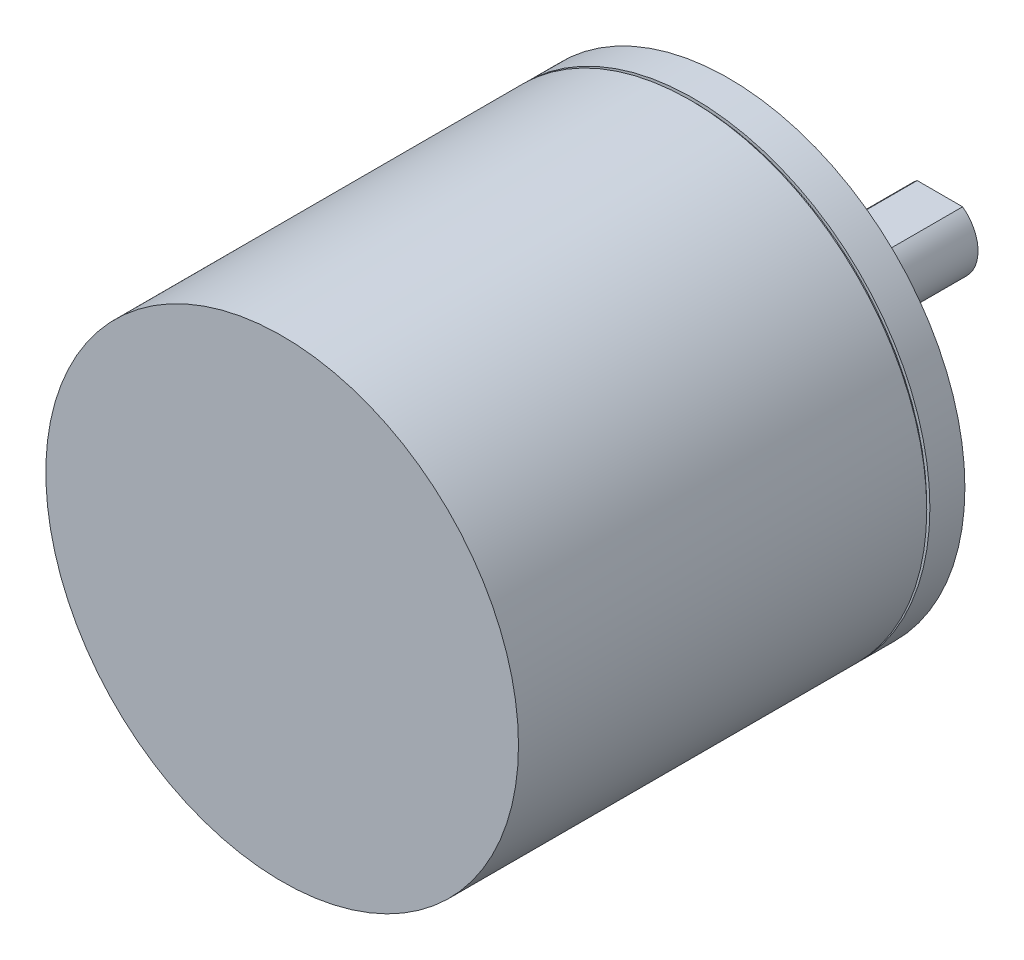
ISO-10303-21;
HEADER;
FILE_DESCRIPTION(('STEP AP214'),'2;1');
FILE_NAME('part.step','',(''),(''),'','','');
FILE_SCHEMA(('AUTOMOTIVE_DESIGN { 1 0 10303 214 1 1 1 1 }'));
ENDSEC;
DATA;
#1=APPLICATION_CONTEXT('core data for automotive mechanical design processes');
#2=APPLICATION_PROTOCOL_DEFINITION('international standard','automotive_design',2000,#1);
#3=PRODUCT_CONTEXT('',#1,'mechanical');
#4=PRODUCT('Part','Part','',(#3));
#5=PRODUCT_RELATED_PRODUCT_CATEGORY('part','',(#4));
#6=PRODUCT_DEFINITION_FORMATION('','',#4);
#7=PRODUCT_DEFINITION_CONTEXT('part definition',#1,'design');
#8=PRODUCT_DEFINITION('design','',#6,#7);
#9=PRODUCT_DEFINITION_SHAPE('','',#8);
#10=(LENGTH_UNIT() NAMED_UNIT(*) SI_UNIT(.MILLI.,.METRE.));
#11=(NAMED_UNIT(*) PLANE_ANGLE_UNIT() SI_UNIT($,.RADIAN.));
#12=(NAMED_UNIT(*) SI_UNIT($,.STERADIAN.) SOLID_ANGLE_UNIT());
#13=UNCERTAINTY_MEASURE_WITH_UNIT(LENGTH_MEASURE(1.E-05),#10,'distance_accuracy_value','');
#14=(GEOMETRIC_REPRESENTATION_CONTEXT(3) GLOBAL_UNCERTAINTY_ASSIGNED_CONTEXT((#13)) GLOBAL_UNIT_ASSIGNED_CONTEXT((#10,
#11,#12)) REPRESENTATION_CONTEXT('',''));
#15=CARTESIAN_POINT('',(0.,0.,0.));
#16=DIRECTION('',(0.,0.,1.));
#17=DIRECTION('',(1.,0.,0.));
#18=AXIS2_PLACEMENT_3D('',#15,#16,#17);
#19=CARTESIAN_POINT('',(0.,0.,0.1));
#20=DIRECTION('',(0.,0.,-1.));
#21=DIRECTION('',(1.,0.,0.));
#22=AXIS2_PLACEMENT_3D('',#19,#20,#21);
#23=CYLINDRICAL_SURFACE('',#22,18.9);
#24=CARTESIAN_POINT('',(0.,0.,-32.8));
#25=DIRECTION('',(0.,0.,1.));
#26=DIRECTION('',(1.,0.,0.));
#27=AXIS2_PLACEMENT_3D('',#24,#25,#26);
#28=CIRCLE('',#27,18.9);
#29=CARTESIAN_POINT('',(18.9,0.,-32.8));
#30=VERTEX_POINT('',#29);
#31=EDGE_CURVE('E41',#30,#30,#28,.F.);
#32=ORIENTED_EDGE('',*,*,#31,.T.);
#33=EDGE_LOOP('',(#32));
#34=FACE_BOUND('',#33,.T.);
#35=CARTESIAN_POINT('',(0.,0.,-35.6));
#36=DIRECTION('',(0.,0.,1.));
#37=DIRECTION('',(1.,0.,0.));
#38=AXIS2_PLACEMENT_3D('',#35,#36,#37);
#39=CIRCLE('',#38,18.9);
#40=CARTESIAN_POINT('',(18.9,0.,-35.6));
#41=VERTEX_POINT('',#40);
#42=EDGE_CURVE('E103',#41,#41,#39,.T.);
#43=ORIENTED_EDGE('',*,*,#42,.T.);
#44=EDGE_LOOP('',(#43));
#45=FACE_BOUND('',#44,.T.);
#46=ADVANCED_FACE('F37',(#34,#45),#23,.T.);
#47=CARTESIAN_POINT('',(0.,0.,-35.6));
#48=DIRECTION('',(0.,0.,-1.));
#49=DIRECTION('',(1.,0.,0.));
#50=AXIS2_PLACEMENT_3D('',#47,#48,#49);
#51=PLANE('',#50);
#52=CARTESIAN_POINT('',(-12.9037785163881,-7.45000000000006,-35.6));
#53=DIRECTION('',(0.,0.,1.));
#54=DIRECTION('',(-0.500000000000004,0.866025403784436,0.));
#55=AXIS2_PLACEMENT_3D('',#52,#53,#54);
#56=CIRCLE('',#55,1.5);
#57=CARTESIAN_POINT('',(-13.6537785163881,-6.15096189432341,-35.6));
#58=VERTEX_POINT('',#57);
#59=EDGE_CURVE('E84',#58,#58,#56,.T.);
#60=ORIENTED_EDGE('',*,*,#59,.T.);
#61=EDGE_LOOP('',(#60));
#62=FACE_BOUND('',#61,.T.);
#63=CARTESIAN_POINT('',(12.9037785163882,-7.44999999999988,-35.6));
#64=DIRECTION('',(0.,0.,1.));
#65=DIRECTION('',(-0.499999999999992,-0.866025403784443,0.));
#66=AXIS2_PLACEMENT_3D('',#63,#64,#65);
#67=CIRCLE('',#66,1.5);
#68=CARTESIAN_POINT('',(12.1537785163882,-8.74903810567655,-35.6));
#69=VERTEX_POINT('',#68);
#70=EDGE_CURVE('E119',#69,#69,#67,.T.);
#71=ORIENTED_EDGE('',*,*,#70,.T.);
#72=EDGE_LOOP('',(#71));
#73=FACE_BOUND('',#72,.T.);
#74=CARTESIAN_POINT('',(0.,14.9,-35.6));
#75=DIRECTION('',(0.,0.,1.));
#76=DIRECTION('',(1.,0.,0.));
#77=AXIS2_PLACEMENT_3D('',#74,#75,#76);
#78=CIRCLE('',#77,1.5);
#79=CARTESIAN_POINT('',(1.5,14.9,-35.6));
#80=VERTEX_POINT('',#79);
#81=EDGE_CURVE('E94',#80,#80,#78,.T.);
#82=ORIENTED_EDGE('',*,*,#81,.T.);
#83=EDGE_LOOP('',(#82));
#84=FACE_BOUND('',#83,.T.);
#85=CARTESIAN_POINT('',(0.,0.,-35.6));
#86=DIRECTION('',(0.,0.,1.));
#87=DIRECTION('',(1.,0.,0.));
#88=AXIS2_PLACEMENT_3D('',#85,#86,#87);
#89=CIRCLE('',#88,10.);
#90=CARTESIAN_POINT('',(10.,0.,-35.6));
#91=VERTEX_POINT('',#90);
#92=EDGE_CURVE('E104',#91,#91,#89,.T.);
#93=ORIENTED_EDGE('',*,*,#92,.T.);
#94=EDGE_LOOP('',(#93));
#95=FACE_BOUND('',#94,.T.);
#96=ORIENTED_EDGE('',*,*,#42,.F.);
#97=EDGE_LOOP('',(#96));
#98=FACE_BOUND('',#97,.T.);
#99=ADVANCED_FACE('F135',(#62,#73,#84,#95,#98),#51,.T.);
#100=CARTESIAN_POINT('',(0.,0.,-40.5));
#101=DIRECTION('',(0.,0.,1.));
#102=DIRECTION('',(-1.,0.,0.));
#103=AXIS2_PLACEMENT_3D('',#100,#101,#102);
#104=CYLINDRICAL_SURFACE('',#103,10.);
#105=CARTESIAN_POINT('',(0.,0.,-40.5));
#106=DIRECTION('',(0.,0.,1.));
#107=DIRECTION('',(1.,0.,0.));
#108=AXIS2_PLACEMENT_3D('',#105,#106,#107);
#109=CIRCLE('',#108,10.);
#110=CARTESIAN_POINT('',(10.,0.,-40.5));
#111=VERTEX_POINT('',#110);
#112=EDGE_CURVE('E75',#111,#111,#109,.T.);
#113=ORIENTED_EDGE('',*,*,#112,.T.);
#114=EDGE_LOOP('',(#113));
#115=FACE_BOUND('',#114,.T.);
#116=ORIENTED_EDGE('',*,*,#92,.F.);
#117=EDGE_LOOP('',(#116));
#118=FACE_BOUND('',#117,.T.);
#119=ADVANCED_FACE('F157',(#115,#118),#104,.T.);
#120=CARTESIAN_POINT('',(0.,0.,-40.5));
#121=DIRECTION('',(0.,0.,-1.));
#122=DIRECTION('',(1.,0.,0.));
#123=AXIS2_PLACEMENT_3D('',#120,#121,#122);
#124=PLANE('',#123);
#125=CARTESIAN_POINT('',(0.,0.,-40.5));
#126=DIRECTION('',(0.,0.,1.));
#127=DIRECTION('',(1.,0.,0.));
#128=AXIS2_PLACEMENT_3D('',#125,#126,#127);
#129=CIRCLE('',#128,7.575);
#130=CARTESIAN_POINT('',(7.575,0.,-40.5));
#131=VERTEX_POINT('',#130);
#132=EDGE_CURVE('E90',#131,#131,#129,.T.);
#133=ORIENTED_EDGE('',*,*,#132,.T.);
#134=EDGE_LOOP('',(#133));
#135=FACE_BOUND('',#134,.T.);
#136=ORIENTED_EDGE('',*,*,#112,.F.);
#137=EDGE_LOOP('',(#136));
#138=FACE_BOUND('',#137,.T.);
#139=ADVANCED_FACE('F179',(#135,#138),#124,.T.);
#140=CARTESIAN_POINT('',(0.,14.9,-27.6));
#141=DIRECTION('',(0.,0.,-1.));
#142=DIRECTION('',(1.,0.,0.));
#143=AXIS2_PLACEMENT_3D('',#140,#141,#142);
#144=CYLINDRICAL_SURFACE('',#143,1.5);
#145=CARTESIAN_POINT('',(0.,14.9,-27.6));
#146=DIRECTION('',(0.,0.,1.));
#147=DIRECTION('',(1.,0.,0.));
#148=AXIS2_PLACEMENT_3D('',#145,#146,#147);
#149=CIRCLE('',#148,1.5);
#150=CARTESIAN_POINT('',(1.5,14.9,-27.6));
#151=VERTEX_POINT('',#150);
#152=EDGE_CURVE('E76',#151,#151,#149,.T.);
#153=ORIENTED_EDGE('',*,*,#152,.T.);
#154=EDGE_LOOP('',(#153));
#155=FACE_BOUND('',#154,.T.);
#156=ORIENTED_EDGE('',*,*,#81,.F.);
#157=EDGE_LOOP('',(#156));
#158=FACE_BOUND('',#157,.T.);
#159=ADVANCED_FACE('F183',(#155,#158),#144,.F.);
#160=CARTESIAN_POINT('',(0.,14.9,-27.6));
#161=DIRECTION('',(0.,0.,-1.));
#162=DIRECTION('',(1.,0.,0.));
#163=AXIS2_PLACEMENT_3D('',#160,#161,#162);
#164=PLANE('',#163);
#165=ORIENTED_EDGE('',*,*,#152,.F.);
#166=EDGE_LOOP('',(#165));
#167=FACE_BOUND('',#166,.T.);
#168=ADVANCED_FACE('F192',(#167),#164,.T.);
#169=CARTESIAN_POINT('',(0.,0.,-39.85));
#170=DIRECTION('',(0.,0.,-1.));
#171=DIRECTION('',(1.,0.,0.));
#172=AXIS2_PLACEMENT_3D('',#169,#170,#171);
#173=CYLINDRICAL_SURFACE('',#172,7.575);
#174=CARTESIAN_POINT('',(0.,0.,-39.85));
#175=DIRECTION('',(0.,0.,1.));
#176=DIRECTION('',(1.,0.,0.));
#177=AXIS2_PLACEMENT_3D('',#174,#175,#176);
#178=CIRCLE('',#177,7.575);
#179=CARTESIAN_POINT('',(7.575,0.,-39.85));
#180=VERTEX_POINT('',#179);
#181=EDGE_CURVE('E91',#180,#180,#178,.T.);
#182=ORIENTED_EDGE('',*,*,#181,.T.);
#183=EDGE_LOOP('',(#182));
#184=FACE_BOUND('',#183,.T.);
#185=ORIENTED_EDGE('',*,*,#132,.F.);
#186=EDGE_LOOP('',(#185));
#187=FACE_BOUND('',#186,.T.);
#188=ADVANCED_FACE('F196',(#184,#187),#173,.F.);
#189=CARTESIAN_POINT('',(0.,0.,-39.85));
#190=DIRECTION('',(0.,0.,-1.));
#191=DIRECTION('',(1.,0.,0.));
#192=AXIS2_PLACEMENT_3D('',#189,#190,#191);
#193=PLANE('',#192);
#194=CARTESIAN_POINT('',(0.,0.,-39.85));
#195=DIRECTION('',(0.,0.,1.));
#196=DIRECTION('',(1.,0.,0.));
#197=AXIS2_PLACEMENT_3D('',#194,#195,#196);
#198=CIRCLE('',#197,3.05);
#199=CARTESIAN_POINT('',(3.05,0.,-39.85));
#200=VERTEX_POINT('',#199);
#201=EDGE_CURVE('E81',#200,#200,#198,.T.);
#202=ORIENTED_EDGE('',*,*,#201,.T.);
#203=EDGE_LOOP('',(#202));
#204=FACE_BOUND('',#203,.T.);
#205=ORIENTED_EDGE('',*,*,#181,.F.);
#206=EDGE_LOOP('',(#205));
#207=FACE_BOUND('',#206,.T.);
#208=ADVANCED_FACE('F189',(#204,#207),#193,.T.);
#209=CARTESIAN_POINT('',(0.,0.,-52.5));
#210=DIRECTION('',(0.,0.,-1.));
#211=DIRECTION('',(1.,0.,0.));
#212=AXIS2_PLACEMENT_3D('',#209,#210,#211);
#213=PLANE('',#212);
#214=DIRECTION('',(1.,0.,0.));
#215=VECTOR('',#214,1.);
#216=CARTESIAN_POINT('',(-4.31706966346971,2.45,-52.5));
#217=LINE('',#216,#215);
#218=CARTESIAN_POINT('',(-1.81659021245849,2.45,-52.5));
#219=VERTEX_POINT('',#218);
#220=CARTESIAN_POINT('',(1.81659021245849,2.45,-52.5));
#221=VERTEX_POINT('',#220);
#222=EDGE_CURVE('E74',#219,#221,#217,.T.);
#223=ORIENTED_EDGE('',*,*,#222,.T.);
#224=CARTESIAN_POINT('',(0.,0.,-52.5));
#225=DIRECTION('',(0.,0.,1.));
#226=DIRECTION('',(1.,0.,0.));
#227=AXIS2_PLACEMENT_3D('',#224,#225,#226);
#228=CIRCLE('',#227,3.05);
#229=EDGE_CURVE('E68',#219,#221,#228,.T.);
#230=ORIENTED_EDGE('',*,*,#229,.F.);
#231=EDGE_LOOP('',(#223,#230));
#232=FACE_BOUND('',#231,.T.);
#233=ADVANCED_FACE('F73',(#232),#213,.T.);
#234=CARTESIAN_POINT('',(0.,0.,-52.5));
#235=DIRECTION('',(0.,0.,1.));
#236=DIRECTION('',(-1.,0.,0.));
#237=AXIS2_PLACEMENT_3D('',#234,#235,#236);
#238=CYLINDRICAL_SURFACE('',#237,3.05);
#239=ORIENTED_EDGE('',*,*,#229,.T.);
#240=DIRECTION('',(0.,0.,1.));
#241=VECTOR('',#240,1.);
#242=CARTESIAN_POINT('',(1.81659021245849,2.45,-52.5));
#243=LINE('',#242,#241);
#244=CARTESIAN_POINT('',(1.81659021245849,2.45,-42.9));
#245=VERTEX_POINT('',#244);
#246=EDGE_CURVE('E46',#245,#221,#243,.F.);
#247=ORIENTED_EDGE('',*,*,#246,.F.);
#248=CARTESIAN_POINT('',(0.,0.,-42.9));
#249=DIRECTION('',(0.,0.,1.));
#250=DIRECTION('',(1.,0.,0.));
#251=AXIS2_PLACEMENT_3D('',#248,#249,#250);
#252=CIRCLE('',#251,3.05);
#253=CARTESIAN_POINT('',(-1.81659021245849,2.45,-42.9));
#254=VERTEX_POINT('',#253);
#255=EDGE_CURVE('E70',#245,#254,#252,.T.);
#256=ORIENTED_EDGE('',*,*,#255,.T.);
#257=DIRECTION('',(0.,0.,1.));
#258=VECTOR('',#257,1.);
#259=CARTESIAN_POINT('',(-1.81659021245849,2.45,-52.5));
#260=LINE('',#259,#258);
#261=EDGE_CURVE('E11',#219,#254,#260,.T.);
#262=ORIENTED_EDGE('',*,*,#261,.F.);
#263=EDGE_LOOP('',(#239,#247,#256,#262));
#264=FACE_BOUND('',#263,.T.);
#265=ORIENTED_EDGE('',*,*,#201,.F.);
#266=EDGE_LOOP('',(#265));
#267=FACE_BOUND('',#266,.T.);
#268=ADVANCED_FACE('F65',(#264,#267),#238,.T.);
#269=CARTESIAN_POINT('',(-4.31706966346971,2.45,-42.9));
#270=DIRECTION('',(0.,-1.,0.));
#271=DIRECTION('',(0.,0.,1.));
#272=AXIS2_PLACEMENT_3D('',#269,#270,#271);
#273=PLANE('',#272);
#274=ORIENTED_EDGE('',*,*,#222,.F.);
#275=ORIENTED_EDGE('',*,*,#261,.T.);
#276=DIRECTION('',(1.,0.,0.));
#277=VECTOR('',#276,1.);
#278=CARTESIAN_POINT('',(-4.31706966346971,2.45,-42.9));
#279=LINE('',#278,#277);
#280=EDGE_CURVE('E53',#254,#245,#279,.T.);
#281=ORIENTED_EDGE('',*,*,#280,.T.);
#282=ORIENTED_EDGE('',*,*,#246,.T.);
#283=EDGE_LOOP('',(#274,#275,#281,#282));
#284=FACE_BOUND('',#283,.T.);
#285=ADVANCED_FACE('F78',(#284),#273,.F.);
#286=CARTESIAN_POINT('',(0.,0.,-42.9));
#287=DIRECTION('',(0.,0.,-1.));
#288=DIRECTION('',(1.,0.,0.));
#289=AXIS2_PLACEMENT_3D('',#286,#287,#288);
#290=PLANE('',#289);
#291=ORIENTED_EDGE('',*,*,#255,.F.);
#292=ORIENTED_EDGE('',*,*,#280,.F.);
#293=EDGE_LOOP('',(#291,#292));
#294=FACE_BOUND('',#293,.T.);
#295=ADVANCED_FACE('F141',(#294),#290,.T.);
#296=CARTESIAN_POINT('',(12.9037785163882,-7.44999999999988,-27.6));
#297=DIRECTION('',(0.,0.,-1.));
#298=DIRECTION('',(1.,0.,0.));
#299=AXIS2_PLACEMENT_3D('',#296,#297,#298);
#300=CYLINDRICAL_SURFACE('',#299,1.5);
#301=CARTESIAN_POINT('',(12.9037785163882,-7.44999999999988,-27.6));
#302=DIRECTION('',(0.,0.,1.));
#303=DIRECTION('',(-0.499999999999992,-0.866025403784443,0.));
#304=AXIS2_PLACEMENT_3D('',#301,#302,#303);
#305=CIRCLE('',#304,1.5);
#306=CARTESIAN_POINT('',(12.1537785163882,-8.74903810567655,-27.6));
#307=VERTEX_POINT('',#306);
#308=EDGE_CURVE('E130',#307,#307,#305,.T.);
#309=ORIENTED_EDGE('',*,*,#308,.T.);
#310=EDGE_LOOP('',(#309));
#311=FACE_BOUND('',#310,.T.);
#312=ORIENTED_EDGE('',*,*,#70,.F.);
#313=EDGE_LOOP('',(#312));
#314=FACE_BOUND('',#313,.T.);
#315=ADVANCED_FACE('F138',(#311,#314),#300,.F.);
#316=CARTESIAN_POINT('',(12.9037785163882,-7.44999999999988,-27.6));
#317=DIRECTION('',(0.,0.,-1.));
#318=DIRECTION('',(-0.499999999999992,-0.866025403784443,0.));
#319=AXIS2_PLACEMENT_3D('',#316,#317,#318);
#320=PLANE('',#319);
#321=ORIENTED_EDGE('',*,*,#308,.F.);
#322=EDGE_LOOP('',(#321));
#323=FACE_BOUND('',#322,.T.);
#324=ADVANCED_FACE('F140',(#323),#320,.T.);
#325=CARTESIAN_POINT('',(-12.9037785163881,-7.45000000000006,-27.6));
#326=DIRECTION('',(0.,0.,-1.));
#327=DIRECTION('',(1.,0.,0.));
#328=AXIS2_PLACEMENT_3D('',#325,#326,#327);
#329=CYLINDRICAL_SURFACE('',#328,1.5);
#330=CARTESIAN_POINT('',(-12.9037785163881,-7.45000000000006,-27.6));
#331=DIRECTION('',(0.,0.,1.));
#332=DIRECTION('',(-0.500000000000004,0.866025403784436,0.));
#333=AXIS2_PLACEMENT_3D('',#330,#331,#332);
#334=CIRCLE('',#333,1.5);
#335=CARTESIAN_POINT('',(-13.6537785163881,-6.15096189432341,-27.6));
#336=VERTEX_POINT('',#335);
#337=EDGE_CURVE('E79',#336,#336,#334,.T.);
#338=ORIENTED_EDGE('',*,*,#337,.T.);
#339=EDGE_LOOP('',(#338));
#340=FACE_BOUND('',#339,.T.);
#341=ORIENTED_EDGE('',*,*,#59,.F.);
#342=EDGE_LOOP('',(#341));
#343=FACE_BOUND('',#342,.T.);
#344=ADVANCED_FACE('F148',(#340,#343),#329,.F.);
#345=CARTESIAN_POINT('',(-12.9037785163881,-7.45000000000006,-27.6));
#346=DIRECTION('',(0.,0.,-1.));
#347=DIRECTION('',(-0.500000000000004,0.866025403784436,0.));
#348=AXIS2_PLACEMENT_3D('',#345,#346,#347);
#349=PLANE('',#348);
#350=ORIENTED_EDGE('',*,*,#337,.F.);
#351=EDGE_LOOP('',(#350));
#352=FACE_BOUND('',#351,.T.);
#353=ADVANCED_FACE('F238',(#352),#349,.T.);
#354=CARTESIAN_POINT('',(0.,21.8461649379907,-32.8));
#355=DIRECTION('',(0.,0.,-1.));
#356=DIRECTION('',(1.,0.,0.));
#357=AXIS2_PLACEMENT_3D('',#354,#355,#356);
#358=PLANE('',#357);
#359=ORIENTED_EDGE('',*,*,#31,.F.);
#360=EDGE_LOOP('',(#359));
#361=FACE_BOUND('',#360,.T.);
#362=CARTESIAN_POINT('',(0.,0.,-32.8));
#363=DIRECTION('',(0.,0.,-1.));
#364=DIRECTION('',(-1.,0.,0.));
#365=AXIS2_PLACEMENT_3D('',#362,#363,#364);
#366=CIRCLE('',#365,18.65);
#367=CARTESIAN_POINT('',(-18.65,0.,-32.8));
#368=VERTEX_POINT('',#367);
#369=EDGE_CURVE('E115',#368,#368,#366,.T.);
#370=ORIENTED_EDGE('',*,*,#369,.T.);
#371=EDGE_LOOP('',(#370));
#372=FACE_BOUND('',#371,.T.);
#373=ADVANCED_FACE('F248',(#361,#372),#358,.F.);
#374=CARTESIAN_POINT('',(0.,0.,0.1));
#375=DIRECTION('',(0.,0.,1.));
#376=DIRECTION('',(-1.,0.,0.));
#377=AXIS2_PLACEMENT_3D('',#374,#375,#376);
#378=CYLINDRICAL_SURFACE('',#377,18.65);
#379=CARTESIAN_POINT('',(0.,0.,-32.55));
#380=DIRECTION('',(0.,0.,-1.));
#381=DIRECTION('',(-1.,0.,0.));
#382=AXIS2_PLACEMENT_3D('',#379,#380,#381);
#383=CIRCLE('',#382,18.65);
#384=CARTESIAN_POINT('',(-18.65,0.,-32.55));
#385=VERTEX_POINT('',#384);
#386=EDGE_CURVE('E121',#385,#385,#383,.T.);
#387=ORIENTED_EDGE('',*,*,#386,.T.);
#388=EDGE_LOOP('',(#387));
#389=FACE_BOUND('',#388,.T.);
#390=ORIENTED_EDGE('',*,*,#369,.F.);
#391=EDGE_LOOP('',(#390));
#392=FACE_BOUND('',#391,.T.);
#393=ADVANCED_FACE('F173',(#389,#392),#378,.T.);
#394=CARTESIAN_POINT('',(0.,21.8461649379907,-32.55));
#395=DIRECTION('',(0.,0.,1.));
#396=DIRECTION('',(-1.,0.,0.));
#397=AXIS2_PLACEMENT_3D('',#394,#395,#396);
#398=PLANE('',#397);
#399=CARTESIAN_POINT('',(0.,0.,-32.55));
#400=DIRECTION('',(0.,0.,-1.));
#401=DIRECTION('',(-1.,0.,0.));
#402=AXIS2_PLACEMENT_3D('',#399,#400,#401);
#403=CIRCLE('',#402,18.9);
#404=CARTESIAN_POINT('',(-18.9,0.,-32.55));
#405=VERTEX_POINT('',#404);
#406=EDGE_CURVE('E113',#405,#405,#403,.F.);
#407=ORIENTED_EDGE('',*,*,#406,.F.);
#408=EDGE_LOOP('',(#407));
#409=FACE_BOUND('',#408,.T.);
#410=ORIENTED_EDGE('',*,*,#386,.F.);
#411=EDGE_LOOP('',(#410));
#412=FACE_BOUND('',#411,.T.);
#413=ADVANCED_FACE('F166',(#409,#412),#398,.F.);
#414=CARTESIAN_POINT('',(0.,0.,0.1));
#415=DIRECTION('',(0.,0.,-1.));
#416=DIRECTION('',(1.,0.,0.));
#417=AXIS2_PLACEMENT_3D('',#414,#415,#416);
#418=PLANE('',#417);
#419=CARTESIAN_POINT('',(0.,0.,0.1));
#420=DIRECTION('',(0.,0.,1.));
#421=DIRECTION('',(1.,0.,0.));
#422=AXIS2_PLACEMENT_3D('',#419,#420,#421);
#423=CIRCLE('',#422,18.9);
#424=CARTESIAN_POINT('',(18.9,0.,0.1));
#425=VERTEX_POINT('',#424);
#426=EDGE_CURVE('E107',#425,#425,#423,.T.);
#427=ORIENTED_EDGE('',*,*,#426,.T.);
#428=EDGE_LOOP('',(#427));
#429=FACE_BOUND('',#428,.T.);
#430=ADVANCED_FACE('F162',(#429),#418,.F.);
#431=ORIENTED_EDGE('',*,*,#406,.T.);
#432=EDGE_LOOP('',(#431));
#433=FACE_BOUND('',#432,.T.);
#434=ORIENTED_EDGE('',*,*,#426,.F.);
#435=EDGE_LOOP('',(#434));
#436=FACE_BOUND('',#435,.T.);
#437=ADVANCED_FACE('F39',(#433,#436),#23,.T.);
#438=CLOSED_SHELL('',(#46,#99,#119,#139,#159,#168,#188,#208,#233,#268,#285,#295,#315,#324,#344,
#353,#373,#393,#413,#430,#437));
#439=MANIFOLD_SOLID_BREP('B2',#438);
#440=ADVANCED_BREP_SHAPE_REPRESENTATION('',(#18,#439),#14);
#441=SHAPE_DEFINITION_REPRESENTATION(#9,#440);
ENDSEC;
END-ISO-10303-21;
